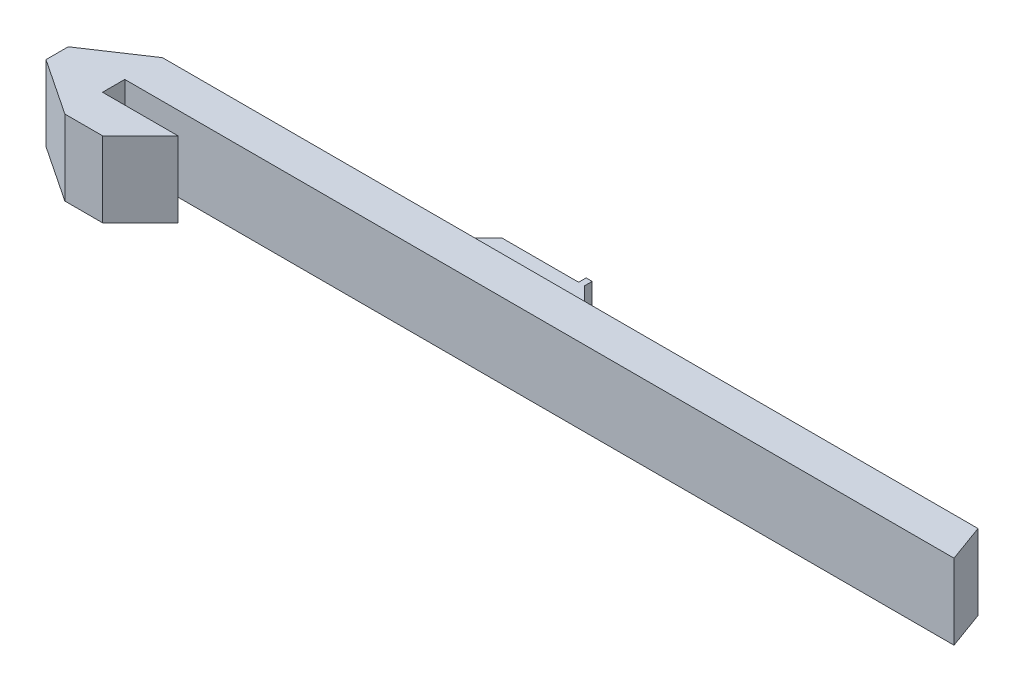
ISO-10303-21;
HEADER;
FILE_DESCRIPTION(('STEP AP214'),'2;1');
FILE_NAME('part.step','',(''),(''),'','','');
FILE_SCHEMA(('AUTOMOTIVE_DESIGN { 1 0 10303 214 1 1 1 1 }'));
ENDSEC;
DATA;
#1=APPLICATION_CONTEXT('core data for automotive mechanical design processes');
#2=APPLICATION_PROTOCOL_DEFINITION('international standard','automotive_design',2000,#1);
#3=PRODUCT_CONTEXT('',#1,'mechanical');
#4=PRODUCT('Part','Part','',(#3));
#5=PRODUCT_RELATED_PRODUCT_CATEGORY('part','',(#4));
#6=PRODUCT_DEFINITION_FORMATION('','',#4);
#7=PRODUCT_DEFINITION_CONTEXT('part definition',#1,'design');
#8=PRODUCT_DEFINITION('design','',#6,#7);
#9=PRODUCT_DEFINITION_SHAPE('','',#8);
#10=(LENGTH_UNIT() NAMED_UNIT(*) SI_UNIT(.MILLI.,.METRE.));
#11=(NAMED_UNIT(*) PLANE_ANGLE_UNIT() SI_UNIT($,.RADIAN.));
#12=(NAMED_UNIT(*) SI_UNIT($,.STERADIAN.) SOLID_ANGLE_UNIT());
#13=UNCERTAINTY_MEASURE_WITH_UNIT(LENGTH_MEASURE(1.E-05),#10,'distance_accuracy_value','');
#14=(GEOMETRIC_REPRESENTATION_CONTEXT(3) GLOBAL_UNCERTAINTY_ASSIGNED_CONTEXT((#13)) GLOBAL_UNIT_ASSIGNED_CONTEXT((#10,
#11,#12)) REPRESENTATION_CONTEXT('',''));
#15=CARTESIAN_POINT('',(0.,0.,0.));
#16=DIRECTION('',(0.,0.,1.));
#17=DIRECTION('',(1.,0.,0.));
#18=AXIS2_PLACEMENT_3D('',#15,#16,#17);
#19=CARTESIAN_POINT('',(61.,20.,-61.));
#20=DIRECTION('',(0.707106781186548,0.,-0.707106781186547));
#21=DIRECTION('',(-0.707106781186547,0.,-0.707106781186548));
#22=AXIS2_PLACEMENT_3D('',#19,#20,#21);
#23=PLANE('',#22);
#24=DIRECTION('',(0.,-1.,0.));
#25=VECTOR('',#24,1.);
#26=CARTESIAN_POINT('',(112.,20.,-9.99999999999999));
#27=LINE('',#26,#25);
#28=CARTESIAN_POINT('',(112.,13.6,-9.99999999999999));
#29=VERTEX_POINT('',#28);
#30=CARTESIAN_POINT('',(112.,6.4,-9.99999999999999));
#31=VERTEX_POINT('',#30);
#32=EDGE_CURVE('E197',#29,#31,#27,.T.);
#33=ORIENTED_EDGE('',*,*,#32,.T.);
#34=DIRECTION('',(0.707106781186547,0.,0.707106781186548));
#35=VECTOR('',#34,1.);
#36=CARTESIAN_POINT('',(112.,6.4,-9.99999999999999));
#37=LINE('',#36,#35);
#38=CARTESIAN_POINT('',(102.,6.4,-20.));
#39=VERTEX_POINT('',#38);
#40=EDGE_CURVE('E257',#39,#31,#37,.T.);
#41=ORIENTED_EDGE('',*,*,#40,.F.);
#42=DIRECTION('',(0.,-1.,0.));
#43=VECTOR('',#42,1.);
#44=CARTESIAN_POINT('',(102.,20.,-20.));
#45=LINE('',#44,#43);
#46=CARTESIAN_POINT('',(102.,13.6,-20.));
#47=VERTEX_POINT('',#46);
#48=EDGE_CURVE('E194',#47,#39,#45,.T.);
#49=ORIENTED_EDGE('',*,*,#48,.F.);
#50=DIRECTION('',(-0.707106781186547,0.,-0.707106781186548));
#51=VECTOR('',#50,1.);
#52=CARTESIAN_POINT('',(112.,13.6,-9.99999999999999));
#53=LINE('',#52,#51);
#54=EDGE_CURVE('E245',#29,#47,#53,.T.);
#55=ORIENTED_EDGE('',*,*,#54,.F.);
#56=EDGE_LOOP('',(#33,#41,#49,#55));
#57=FACE_BOUND('',#56,.T.);
#58=ADVANCED_FACE('F36',(#57),#23,.T.);
#59=CARTESIAN_POINT('',(0.,20.,-20.));
#60=DIRECTION('',(0.,0.,-1.));
#61=DIRECTION('',(-1.,0.,0.));
#62=AXIS2_PLACEMENT_3D('',#59,#60,#61);
#63=PLANE('',#62);
#64=DIRECTION('',(0.,1.,0.));
#65=VECTOR('',#64,1.);
#66=CARTESIAN_POINT('',(100.4,13.6,-20.));
#67=LINE('',#66,#65);
#68=CARTESIAN_POINT('',(100.4,6.4,-20.));
#69=VERTEX_POINT('',#68);
#70=CARTESIAN_POINT('',(100.4,13.6,-20.));
#71=VERTEX_POINT('',#70);
#72=EDGE_CURVE('E51',#69,#71,#67,.T.);
#73=ORIENTED_EDGE('',*,*,#72,.F.);
#74=DIRECTION('',(1.,0.,0.));
#75=VECTOR('',#74,1.);
#76=CARTESIAN_POINT('',(102.,6.4,-20.));
#77=LINE('',#76,#75);
#78=CARTESIAN_POINT('',(80.,6.4,-20.));
#79=VERTEX_POINT('',#78);
#80=EDGE_CURVE('E260',#79,#69,#77,.T.);
#81=ORIENTED_EDGE('',*,*,#80,.F.);
#82=DIRECTION('',(0.,-1.,0.));
#83=VECTOR('',#82,1.);
#84=CARTESIAN_POINT('',(80.,20.,-20.));
#85=LINE('',#84,#83);
#86=CARTESIAN_POINT('',(80.,13.6,-20.));
#87=VERTEX_POINT('',#86);
#88=EDGE_CURVE('E191',#87,#79,#85,.T.);
#89=ORIENTED_EDGE('',*,*,#88,.F.);
#90=DIRECTION('',(-1.,0.,0.));
#91=VECTOR('',#90,1.);
#92=CARTESIAN_POINT('',(102.,13.6,-20.));
#93=LINE('',#92,#91);
#94=EDGE_CURVE('E160',#71,#87,#93,.T.);
#95=ORIENTED_EDGE('',*,*,#94,.F.);
#96=EDGE_LOOP('',(#73,#81,#89,#95));
#97=FACE_BOUND('',#96,.T.);
#98=ADVANCED_FACE('F335',(#97),#63,.T.);
#99=CARTESIAN_POINT('',(29.9999999999999,20.,30.));
#100=DIRECTION('',(-0.707106781186547,0.,-0.707106781186548));
#101=DIRECTION('',(-0.707106781186548,0.,0.707106781186547));
#102=AXIS2_PLACEMENT_3D('',#99,#100,#101);
#103=PLANE('',#102);
#104=ORIENTED_EDGE('',*,*,#88,.T.);
#105=DIRECTION('',(0.707106781186549,0.,-0.707106781186546));
#106=VECTOR('',#105,1.);
#107=CARTESIAN_POINT('',(80.,6.4,-20.));
#108=LINE('',#107,#106);
#109=CARTESIAN_POINT('',(70.,6.4,-9.99999999999998));
#110=VERTEX_POINT('',#109);
#111=EDGE_CURVE('E262',#110,#79,#108,.T.);
#112=ORIENTED_EDGE('',*,*,#111,.F.);
#113=DIRECTION('',(0.,-1.,0.));
#114=VECTOR('',#113,1.);
#115=CARTESIAN_POINT('',(70.,20.,-9.99999999999998));
#116=LINE('',#115,#114);
#117=CARTESIAN_POINT('',(70.,13.6,-9.99999999999998));
#118=VERTEX_POINT('',#117);
#119=EDGE_CURVE('E188',#118,#110,#116,.T.);
#120=ORIENTED_EDGE('',*,*,#119,.F.);
#121=DIRECTION('',(-0.707106781186549,0.,0.707106781186546));
#122=VECTOR('',#121,1.);
#123=CARTESIAN_POINT('',(80.,13.6,-20.));
#124=LINE('',#123,#122);
#125=EDGE_CURVE('E251',#87,#118,#124,.T.);
#126=ORIENTED_EDGE('',*,*,#125,.F.);
#127=EDGE_LOOP('',(#104,#112,#120,#126));
#128=FACE_BOUND('',#127,.T.);
#129=ADVANCED_FACE('F333',(#128),#103,.T.);
#130=CARTESIAN_POINT('',(0.,20.,5.9));
#131=DIRECTION('',(0.,0.,1.));
#132=DIRECTION('',(1.,0.,0.));
#133=AXIS2_PLACEMENT_3D('',#130,#131,#132);
#134=PLANE('',#133);
#135=DIRECTION('',(-1.,0.,0.));
#136=VECTOR('',#135,1.);
#137=CARTESIAN_POINT('',(0.,0.,5.9));
#138=LINE('',#137,#136);
#139=CARTESIAN_POINT('',(20.,0.,5.9));
#140=VERTEX_POINT('',#139);
#141=CARTESIAN_POINT('',(0.,0.,5.9));
#142=VERTEX_POINT('',#141);
#143=EDGE_CURVE('E156',#140,#142,#138,.T.);
#144=ORIENTED_EDGE('',*,*,#143,.T.);
#145=DIRECTION('',(0.,-1.,0.));
#146=VECTOR('',#145,1.);
#147=CARTESIAN_POINT('',(0.,20.,5.9));
#148=LINE('',#147,#146);
#149=CARTESIAN_POINT('',(0.,20.,5.9));
#150=VERTEX_POINT('',#149);
#151=EDGE_CURVE('E11',#150,#142,#148,.T.);
#152=ORIENTED_EDGE('',*,*,#151,.F.);
#153=DIRECTION('',(-1.,0.,0.));
#154=VECTOR('',#153,1.);
#155=CARTESIAN_POINT('',(0.,20.,5.9));
#156=LINE('',#155,#154);
#157=CARTESIAN_POINT('',(20.,20.,5.9));
#158=VERTEX_POINT('',#157);
#159=EDGE_CURVE('E178',#158,#150,#156,.T.);
#160=ORIENTED_EDGE('',*,*,#159,.F.);
#161=DIRECTION('',(0.,-1.,0.));
#162=VECTOR('',#161,1.);
#163=CARTESIAN_POINT('',(20.,20.,5.9));
#164=LINE('',#163,#162);
#165=EDGE_CURVE('E152',#158,#140,#164,.T.);
#166=ORIENTED_EDGE('',*,*,#165,.T.);
#167=EDGE_LOOP('',(#144,#152,#160,#166));
#168=FACE_BOUND('',#167,.T.);
#169=ADVANCED_FACE('F38',(#168),#134,.F.);
#170=CARTESIAN_POINT('',(0.,20.,0.));
#171=DIRECTION('',(-1.,0.,0.));
#172=DIRECTION('',(0.,0.,1.));
#173=AXIS2_PLACEMENT_3D('',#170,#171,#172);
#174=PLANE('',#173);
#175=DIRECTION('',(0.,0.,-1.));
#176=VECTOR('',#175,1.);
#177=CARTESIAN_POINT('',(0.,0.,0.));
#178=LINE('',#177,#176);
#179=CARTESIAN_POINT('',(0.,0.,0.));
#180=VERTEX_POINT('',#179);
#181=EDGE_CURVE('E159',#142,#180,#178,.T.);
#182=ORIENTED_EDGE('',*,*,#181,.T.);
#183=DIRECTION('',(0.,-1.,0.));
#184=VECTOR('',#183,1.);
#185=CARTESIAN_POINT('',(0.,20.,0.));
#186=LINE('',#185,#184);
#187=CARTESIAN_POINT('',(0.,20.,0.));
#188=VERTEX_POINT('',#187);
#189=EDGE_CURVE('E44',#188,#180,#186,.T.);
#190=ORIENTED_EDGE('',*,*,#189,.F.);
#191=DIRECTION('',(0.,0.,-1.));
#192=VECTOR('',#191,1.);
#193=CARTESIAN_POINT('',(0.,20.,0.));
#194=LINE('',#193,#192);
#195=EDGE_CURVE('E107',#150,#188,#194,.T.);
#196=ORIENTED_EDGE('',*,*,#195,.F.);
#197=ORIENTED_EDGE('',*,*,#151,.T.);
#198=EDGE_LOOP('',(#182,#190,#196,#197));
#199=FACE_BOUND('',#198,.T.);
#200=ADVANCED_FACE('F363',(#199),#174,.F.);
#201=CARTESIAN_POINT('',(0.,20.,0.));
#202=DIRECTION('',(0.,0.,-1.));
#203=DIRECTION('',(-1.,0.,0.));
#204=AXIS2_PLACEMENT_3D('',#201,#202,#203);
#205=PLANE('',#204);
#206=DIRECTION('',(1.,0.,0.));
#207=VECTOR('',#206,1.);
#208=CARTESIAN_POINT('',(0.,0.,0.));
#209=LINE('',#208,#207);
#210=CARTESIAN_POINT('',(220.,0.,0.));
#211=VERTEX_POINT('',#210);
#212=EDGE_CURVE('E162',#180,#211,#209,.T.);
#213=ORIENTED_EDGE('',*,*,#212,.T.);
#214=DIRECTION('',(0.,-1.,0.));
#215=VECTOR('',#214,1.);
#216=CARTESIAN_POINT('',(220.,20.,0.));
#217=LINE('',#216,#215);
#218=CARTESIAN_POINT('',(220.,20.,0.));
#219=VERTEX_POINT('',#218);
#220=EDGE_CURVE('E203',#219,#211,#217,.T.);
#221=ORIENTED_EDGE('',*,*,#220,.F.);
#222=DIRECTION('',(1.,0.,0.));
#223=VECTOR('',#222,1.);
#224=CARTESIAN_POINT('',(0.,20.,0.));
#225=LINE('',#224,#223);
#226=EDGE_CURVE('E210',#188,#219,#225,.T.);
#227=ORIENTED_EDGE('',*,*,#226,.F.);
#228=ORIENTED_EDGE('',*,*,#189,.T.);
#229=EDGE_LOOP('',(#213,#221,#227,#228));
#230=FACE_BOUND('',#229,.T.);
#231=ADVANCED_FACE('F208',(#230),#205,.F.);
#232=CARTESIAN_POINT('',(194.264888743088,20.,-70.7066370655186));
#233=DIRECTION('',(0.93969262078591,0.,-0.342020143325665));
#234=DIRECTION('',(-0.342020143325665,0.,-0.93969262078591));
#235=AXIS2_PLACEMENT_3D('',#232,#233,#234);
#236=PLANE('',#235);
#237=DIRECTION('',(0.342020143325665,0.,0.93969262078591));
#238=VECTOR('',#237,1.);
#239=CARTESIAN_POINT('',(194.264888743088,0.,-70.7066370655186));
#240=LINE('',#239,#238);
#241=CARTESIAN_POINT('',(216.360297657338,0.,-10.));
#242=VERTEX_POINT('',#241);
#243=EDGE_CURVE('E165',#242,#211,#240,.T.);
#244=ORIENTED_EDGE('',*,*,#243,.F.);
#245=DIRECTION('',(0.,-1.,0.));
#246=VECTOR('',#245,1.);
#247=CARTESIAN_POINT('',(216.360297657338,20.,-10.));
#248=LINE('',#247,#246);
#249=CARTESIAN_POINT('',(216.360297657338,20.,-10.));
#250=VERTEX_POINT('',#249);
#251=EDGE_CURVE('E200',#250,#242,#248,.T.);
#252=ORIENTED_EDGE('',*,*,#251,.F.);
#253=DIRECTION('',(0.342020143325665,0.,0.93969262078591));
#254=VECTOR('',#253,1.);
#255=CARTESIAN_POINT('',(194.264888743088,20.,-70.7066370655186));
#256=LINE('',#255,#254);
#257=EDGE_CURVE('E221',#250,#219,#256,.T.);
#258=ORIENTED_EDGE('',*,*,#257,.T.);
#259=ORIENTED_EDGE('',*,*,#220,.T.);
#260=EDGE_LOOP('',(#244,#252,#258,#259));
#261=FACE_BOUND('',#260,.T.);
#262=ADVANCED_FACE('F217',(#261),#236,.T.);
#263=CARTESIAN_POINT('',(0.,20.,-9.99999999999997));
#264=DIRECTION('',(0.,0.,1.));
#265=DIRECTION('',(1.,0.,0.));
#266=AXIS2_PLACEMENT_3D('',#263,#264,#265);
#267=PLANE('',#266);
#268=ORIENTED_EDGE('',*,*,#251,.T.);
#269=DIRECTION('',(-1.,0.,0.));
#270=VECTOR('',#269,1.);
#271=CARTESIAN_POINT('',(0.,0.,-9.99999999999997));
#272=LINE('',#271,#270);
#273=CARTESIAN_POINT('',(0.,0.,-9.99999999999997));
#274=VERTEX_POINT('',#273);
#275=EDGE_CURVE('E168',#242,#274,#272,.T.);
#276=ORIENTED_EDGE('',*,*,#275,.T.);
#277=DIRECTION('',(0.,-1.,0.));
#278=VECTOR('',#277,1.);
#279=CARTESIAN_POINT('',(0.,20.,-9.99999999999997));
#280=LINE('',#279,#278);
#281=CARTESIAN_POINT('',(0.,20.,-9.99999999999997));
#282=VERTEX_POINT('',#281);
#283=EDGE_CURVE('E185',#282,#274,#280,.T.);
#284=ORIENTED_EDGE('',*,*,#283,.F.);
#285=DIRECTION('',(-1.,0.,0.));
#286=VECTOR('',#285,1.);
#287=CARTESIAN_POINT('',(0.,20.,-9.99999999999997));
#288=LINE('',#287,#286);
#289=EDGE_CURVE('E222',#250,#282,#288,.T.);
#290=ORIENTED_EDGE('',*,*,#289,.F.);
#291=EDGE_LOOP('',(#268,#276,#284,#290));
#292=FACE_BOUND('',#291,.T.);
#293=ORIENTED_EDGE('',*,*,#119,.T.);
#294=DIRECTION('',(-1.,0.,0.));
#295=VECTOR('',#294,1.);
#296=CARTESIAN_POINT('',(70.,6.4,-9.99999999999998));
#297=LINE('',#296,#295);
#298=EDGE_CURVE('E254',#31,#110,#297,.T.);
#299=ORIENTED_EDGE('',*,*,#298,.F.);
#300=ORIENTED_EDGE('',*,*,#32,.F.);
#301=DIRECTION('',(1.,0.,0.));
#302=VECTOR('',#301,1.);
#303=CARTESIAN_POINT('',(70.,13.6,-9.99999999999998));
#304=LINE('',#303,#302);
#305=EDGE_CURVE('E248',#118,#29,#304,.T.);
#306=ORIENTED_EDGE('',*,*,#305,.F.);
#307=EDGE_LOOP('',(#293,#299,#300,#306));
#308=FACE_BOUND('',#307,.T.);
#309=ADVANCED_FACE('F361',(#292,#308),#267,.F.);
#310=CARTESIAN_POINT('',(-4.6153846153846,20.,-6.92307692307692));
#311=DIRECTION('',(0.554700196225228,0.,0.832050294337844));
#312=DIRECTION('',(0.832050294337844,0.,-0.554700196225228));
#313=AXIS2_PLACEMENT_3D('',#310,#311,#312);
#314=PLANE('',#313);
#315=DIRECTION('',(-0.832050294337844,0.,0.554700196225228));
#316=VECTOR('',#315,1.);
#317=CARTESIAN_POINT('',(-4.6153846153846,0.,-6.92307692307692));
#318=LINE('',#317,#316);
#319=CARTESIAN_POINT('',(-15.,0.,0.));
#320=VERTEX_POINT('',#319);
#321=EDGE_CURVE('E170',#274,#320,#318,.T.);
#322=ORIENTED_EDGE('',*,*,#321,.T.);
#323=DIRECTION('',(0.,-1.,0.));
#324=VECTOR('',#323,1.);
#325=CARTESIAN_POINT('',(-15.,20.,0.));
#326=LINE('',#325,#324);
#327=CARTESIAN_POINT('',(-15.,20.,0.));
#328=VERTEX_POINT('',#327);
#329=EDGE_CURVE('E182',#328,#320,#326,.T.);
#330=ORIENTED_EDGE('',*,*,#329,.F.);
#331=DIRECTION('',(-0.832050294337844,0.,0.554700196225228));
#332=VECTOR('',#331,1.);
#333=CARTESIAN_POINT('',(-4.6153846153846,20.,-6.92307692307692));
#334=LINE('',#333,#332);
#335=EDGE_CURVE('E224',#282,#328,#334,.T.);
#336=ORIENTED_EDGE('',*,*,#335,.F.);
#337=ORIENTED_EDGE('',*,*,#283,.T.);
#338=EDGE_LOOP('',(#322,#330,#336,#337));
#339=FACE_BOUND('',#338,.T.);
#340=ADVANCED_FACE('F233',(#339),#314,.F.);
#341=CARTESIAN_POINT('',(-15.,20.,0.));
#342=DIRECTION('',(1.,0.,0.));
#343=DIRECTION('',(0.,0.,-1.));
#344=AXIS2_PLACEMENT_3D('',#341,#342,#343);
#345=PLANE('',#344);
#346=DIRECTION('',(0.,0.,1.));
#347=VECTOR('',#346,1.);
#348=CARTESIAN_POINT('',(-15.,0.,0.));
#349=LINE('',#348,#347);
#350=CARTESIAN_POINT('',(-15.,0.,5.9));
#351=VERTEX_POINT('',#350);
#352=EDGE_CURVE('E172',#320,#351,#349,.T.);
#353=ORIENTED_EDGE('',*,*,#352,.T.);
#354=DIRECTION('',(0.,-1.,0.));
#355=VECTOR('',#354,1.);
#356=CARTESIAN_POINT('',(-15.,20.,5.9));
#357=LINE('',#356,#355);
#358=CARTESIAN_POINT('',(-15.,20.,5.9));
#359=VERTEX_POINT('',#358);
#360=EDGE_CURVE('E147',#359,#351,#357,.T.);
#361=ORIENTED_EDGE('',*,*,#360,.F.);
#362=DIRECTION('',(0.,0.,1.));
#363=VECTOR('',#362,1.);
#364=CARTESIAN_POINT('',(-15.,20.,0.));
#365=LINE('',#364,#363);
#366=EDGE_CURVE('E135',#328,#359,#365,.T.);
#367=ORIENTED_EDGE('',*,*,#366,.F.);
#368=ORIENTED_EDGE('',*,*,#329,.T.);
#369=EDGE_LOOP('',(#353,#361,#367,#368));
#370=FACE_BOUND('',#369,.T.);
#371=ADVANCED_FACE('F236',(#370),#345,.F.);
#372=CARTESIAN_POINT('',(-7.33846153846154,20.,11.0076923076923));
#373=DIRECTION('',(0.554700196225229,0.,-0.832050294337844));
#374=DIRECTION('',(-0.832050294337844,0.,-0.554700196225229));
#375=AXIS2_PLACEMENT_3D('',#372,#373,#374);
#376=PLANE('',#375);
#377=DIRECTION('',(0.832050294337844,0.,0.554700196225229));
#378=VECTOR('',#377,1.);
#379=CARTESIAN_POINT('',(-7.33846153846154,0.,11.0076923076923));
#380=LINE('',#379,#378);
#381=CARTESIAN_POINT('',(0.,0.,15.9));
#382=VERTEX_POINT('',#381);
#383=EDGE_CURVE('E144',#351,#382,#380,.T.);
#384=ORIENTED_EDGE('',*,*,#383,.T.);
#385=DIRECTION('',(0.,-1.,0.));
#386=VECTOR('',#385,1.);
#387=CARTESIAN_POINT('',(0.,20.,15.9));
#388=LINE('',#387,#386);
#389=CARTESIAN_POINT('',(0.,20.,15.9));
#390=VERTEX_POINT('',#389);
#391=EDGE_CURVE('E141',#390,#382,#388,.T.);
#392=ORIENTED_EDGE('',*,*,#391,.F.);
#393=DIRECTION('',(0.832050294337844,0.,0.554700196225229));
#394=VECTOR('',#393,1.);
#395=CARTESIAN_POINT('',(-7.33846153846154,20.,11.0076923076923));
#396=LINE('',#395,#394);
#397=EDGE_CURVE('E128',#359,#390,#396,.T.);
#398=ORIENTED_EDGE('',*,*,#397,.F.);
#399=ORIENTED_EDGE('',*,*,#360,.T.);
#400=EDGE_LOOP('',(#384,#392,#398,#399));
#401=FACE_BOUND('',#400,.T.);
#402=ADVANCED_FACE('F142',(#401),#376,.F.);
#403=CARTESIAN_POINT('',(0.,20.,15.9));
#404=DIRECTION('',(0.,0.,-1.));
#405=DIRECTION('',(-1.,0.,0.));
#406=AXIS2_PLACEMENT_3D('',#403,#404,#405);
#407=PLANE('',#406);
#408=DIRECTION('',(1.,0.,0.));
#409=VECTOR('',#408,1.);
#410=CARTESIAN_POINT('',(0.,0.,15.9));
#411=LINE('',#410,#409);
#412=CARTESIAN_POINT('',(10.,0.,15.9));
#413=VERTEX_POINT('',#412);
#414=EDGE_CURVE('E175',#382,#413,#411,.T.);
#415=ORIENTED_EDGE('',*,*,#414,.T.);
#416=DIRECTION('',(0.,-1.,0.));
#417=VECTOR('',#416,1.);
#418=CARTESIAN_POINT('',(10.,20.,15.9));
#419=LINE('',#418,#417);
#420=CARTESIAN_POINT('',(10.,20.,15.9));
#421=VERTEX_POINT('',#420);
#422=EDGE_CURVE('E148',#421,#413,#419,.T.);
#423=ORIENTED_EDGE('',*,*,#422,.F.);
#424=DIRECTION('',(1.,0.,0.));
#425=VECTOR('',#424,1.);
#426=CARTESIAN_POINT('',(0.,20.,15.9));
#427=LINE('',#426,#425);
#428=EDGE_CURVE('E132',#390,#421,#427,.T.);
#429=ORIENTED_EDGE('',*,*,#428,.F.);
#430=ORIENTED_EDGE('',*,*,#391,.T.);
#431=EDGE_LOOP('',(#415,#423,#429,#430));
#432=FACE_BOUND('',#431,.T.);
#433=ADVANCED_FACE('F150',(#432),#407,.F.);
#434=CARTESIAN_POINT('',(12.95,20.,12.95));
#435=DIRECTION('',(-0.707106781186549,0.,-0.707106781186546));
#436=DIRECTION('',(-0.707106781186546,0.,0.707106781186549));
#437=AXIS2_PLACEMENT_3D('',#434,#435,#436);
#438=PLANE('',#437);
#439=DIRECTION('',(0.707106781186546,0.,-0.707106781186549));
#440=VECTOR('',#439,1.);
#441=CARTESIAN_POINT('',(12.95,0.,12.95));
#442=LINE('',#441,#440);
#443=EDGE_CURVE('E99',#413,#140,#442,.T.);
#444=ORIENTED_EDGE('',*,*,#443,.T.);
#445=ORIENTED_EDGE('',*,*,#165,.F.);
#446=DIRECTION('',(0.707106781186546,0.,-0.707106781186549));
#447=VECTOR('',#446,1.);
#448=CARTESIAN_POINT('',(12.95,20.,12.95));
#449=LINE('',#448,#447);
#450=EDGE_CURVE('E60',#421,#158,#449,.T.);
#451=ORIENTED_EDGE('',*,*,#450,.F.);
#452=ORIENTED_EDGE('',*,*,#422,.T.);
#453=EDGE_LOOP('',(#444,#445,#451,#452));
#454=FACE_BOUND('',#453,.T.);
#455=ADVANCED_FACE('F237',(#454),#438,.F.);
#456=CARTESIAN_POINT('',(0.,20.,0.));
#457=DIRECTION('',(0.,1.,0.));
#458=DIRECTION('',(0.,0.,1.));
#459=AXIS2_PLACEMENT_3D('',#456,#457,#458);
#460=PLANE('',#459);
#461=ORIENTED_EDGE('',*,*,#289,.T.);
#462=ORIENTED_EDGE('',*,*,#335,.T.);
#463=ORIENTED_EDGE('',*,*,#366,.T.);
#464=ORIENTED_EDGE('',*,*,#397,.T.);
#465=ORIENTED_EDGE('',*,*,#428,.T.);
#466=ORIENTED_EDGE('',*,*,#450,.T.);
#467=ORIENTED_EDGE('',*,*,#159,.T.);
#468=ORIENTED_EDGE('',*,*,#195,.T.);
#469=ORIENTED_EDGE('',*,*,#226,.T.);
#470=ORIENTED_EDGE('',*,*,#257,.F.);
#471=EDGE_LOOP('',(#461,#462,#463,#464,#465,#466,#467,#468,#469,#470));
#472=FACE_BOUND('',#471,.T.);
#473=ADVANCED_FACE('F130',(#472),#460,.T.);
#474=CARTESIAN_POINT('',(0.,0.,0.));
#475=DIRECTION('',(0.,1.,0.));
#476=DIRECTION('',(0.,0.,1.));
#477=AXIS2_PLACEMENT_3D('',#474,#475,#476);
#478=PLANE('',#477);
#479=ORIENTED_EDGE('',*,*,#275,.F.);
#480=ORIENTED_EDGE('',*,*,#243,.T.);
#481=ORIENTED_EDGE('',*,*,#212,.F.);
#482=ORIENTED_EDGE('',*,*,#181,.F.);
#483=ORIENTED_EDGE('',*,*,#143,.F.);
#484=ORIENTED_EDGE('',*,*,#443,.F.);
#485=ORIENTED_EDGE('',*,*,#414,.F.);
#486=ORIENTED_EDGE('',*,*,#383,.F.);
#487=ORIENTED_EDGE('',*,*,#352,.F.);
#488=ORIENTED_EDGE('',*,*,#321,.F.);
#489=EDGE_LOOP('',(#479,#480,#481,#482,#483,#484,#485,#486,#487,#488));
#490=FACE_BOUND('',#489,.T.);
#491=ADVANCED_FACE('F212',(#490),#478,.F.);
#492=CARTESIAN_POINT('',(0.,13.6,0.));
#493=DIRECTION('',(0.,-1.,0.));
#494=DIRECTION('',(0.,0.,-1.));
#495=AXIS2_PLACEMENT_3D('',#492,#493,#494);
#496=PLANE('',#495);
#497=ORIENTED_EDGE('',*,*,#125,.T.);
#498=ORIENTED_EDGE('',*,*,#305,.T.);
#499=ORIENTED_EDGE('',*,*,#54,.T.);
#500=DIRECTION('',(0.,0.,1.));
#501=VECTOR('',#500,1.);
#502=CARTESIAN_POINT('',(102.,13.6,-22.));
#503=LINE('',#502,#501);
#504=CARTESIAN_POINT('',(102.,13.6,-22.));
#505=VERTEX_POINT('',#504);
#506=EDGE_CURVE('E274',#505,#47,#503,.T.);
#507=ORIENTED_EDGE('',*,*,#506,.F.);
#508=DIRECTION('',(1.,0.,0.));
#509=VECTOR('',#508,1.);
#510=CARTESIAN_POINT('',(102.,13.6,-22.));
#511=LINE('',#510,#509);
#512=CARTESIAN_POINT('',(100.4,13.6,-22.));
#513=VERTEX_POINT('',#512);
#514=EDGE_CURVE('E277',#513,#505,#511,.T.);
#515=ORIENTED_EDGE('',*,*,#514,.F.);
#516=DIRECTION('',(0.,0.,1.));
#517=VECTOR('',#516,1.);
#518=CARTESIAN_POINT('',(100.4,13.6,-22.));
#519=LINE('',#518,#517);
#520=EDGE_CURVE('E271',#513,#71,#519,.T.);
#521=ORIENTED_EDGE('',*,*,#520,.T.);
#522=ORIENTED_EDGE('',*,*,#94,.T.);
#523=EDGE_LOOP('',(#497,#498,#499,#507,#515,#521,#522));
#524=FACE_BOUND('',#523,.T.);
#525=ADVANCED_FACE('F328',(#524),#496,.F.);
#526=CARTESIAN_POINT('',(0.,6.4,0.));
#527=DIRECTION('',(0.,-1.,0.));
#528=DIRECTION('',(0.,0.,-1.));
#529=AXIS2_PLACEMENT_3D('',#526,#527,#528);
#530=PLANE('',#529);
#531=ORIENTED_EDGE('',*,*,#111,.T.);
#532=ORIENTED_EDGE('',*,*,#80,.T.);
#533=DIRECTION('',(0.,0.,1.));
#534=VECTOR('',#533,1.);
#535=CARTESIAN_POINT('',(100.4,6.4,-22.));
#536=LINE('',#535,#534);
#537=CARTESIAN_POINT('',(100.4,6.4,-22.));
#538=VERTEX_POINT('',#537);
#539=EDGE_CURVE('E268',#538,#69,#536,.T.);
#540=ORIENTED_EDGE('',*,*,#539,.F.);
#541=DIRECTION('',(-1.,0.,0.));
#542=VECTOR('',#541,1.);
#543=CARTESIAN_POINT('',(102.,6.4,-22.));
#544=LINE('',#543,#542);
#545=CARTESIAN_POINT('',(102.,6.4,-22.));
#546=VERTEX_POINT('',#545);
#547=EDGE_CURVE('E285',#546,#538,#544,.T.);
#548=ORIENTED_EDGE('',*,*,#547,.F.);
#549=DIRECTION('',(0.,0.,1.));
#550=VECTOR('',#549,1.);
#551=CARTESIAN_POINT('',(102.,6.4,-22.));
#552=LINE('',#551,#550);
#553=EDGE_CURVE('E265',#546,#39,#552,.T.);
#554=ORIENTED_EDGE('',*,*,#553,.T.);
#555=ORIENTED_EDGE('',*,*,#40,.T.);
#556=ORIENTED_EDGE('',*,*,#298,.T.);
#557=EDGE_LOOP('',(#531,#532,#540,#548,#554,#555,#556));
#558=FACE_BOUND('',#557,.T.);
#559=ADVANCED_FACE('F307',(#558),#530,.T.);
#560=CARTESIAN_POINT('',(102.,13.6,-22.));
#561=DIRECTION('',(-1.,0.,0.));
#562=DIRECTION('',(0.,0.,1.));
#563=AXIS2_PLACEMENT_3D('',#560,#561,#562);
#564=PLANE('',#563);
#565=ORIENTED_EDGE('',*,*,#48,.T.);
#566=ORIENTED_EDGE('',*,*,#553,.F.);
#567=DIRECTION('',(0.,-1.,0.));
#568=VECTOR('',#567,1.);
#569=CARTESIAN_POINT('',(102.,13.6,-22.));
#570=LINE('',#569,#568);
#571=EDGE_CURVE('E279',#505,#546,#570,.T.);
#572=ORIENTED_EDGE('',*,*,#571,.F.);
#573=ORIENTED_EDGE('',*,*,#506,.T.);
#574=EDGE_LOOP('',(#565,#566,#572,#573));
#575=FACE_BOUND('',#574,.T.);
#576=ADVANCED_FACE('F303',(#575),#564,.F.);
#577=CARTESIAN_POINT('',(100.4,13.6,-22.));
#578=DIRECTION('',(1.,0.,0.));
#579=DIRECTION('',(0.,0.,-1.));
#580=AXIS2_PLACEMENT_3D('',#577,#578,#579);
#581=PLANE('',#580);
#582=ORIENTED_EDGE('',*,*,#72,.T.);
#583=ORIENTED_EDGE('',*,*,#520,.F.);
#584=DIRECTION('',(0.,1.,0.));
#585=VECTOR('',#584,1.);
#586=CARTESIAN_POINT('',(100.4,13.6,-22.));
#587=LINE('',#586,#585);
#588=EDGE_CURVE('E282',#538,#513,#587,.T.);
#589=ORIENTED_EDGE('',*,*,#588,.F.);
#590=ORIENTED_EDGE('',*,*,#539,.T.);
#591=EDGE_LOOP('',(#582,#583,#589,#590));
#592=FACE_BOUND('',#591,.T.);
#593=ADVANCED_FACE('F338',(#592),#581,.F.);
#594=CARTESIAN_POINT('',(0.,0.,-22.));
#595=DIRECTION('',(0.,0.,-1.));
#596=DIRECTION('',(-1.,0.,0.));
#597=AXIS2_PLACEMENT_3D('',#594,#595,#596);
#598=PLANE('',#597);
#599=ORIENTED_EDGE('',*,*,#571,.T.);
#600=ORIENTED_EDGE('',*,*,#547,.T.);
#601=ORIENTED_EDGE('',*,*,#588,.T.);
#602=ORIENTED_EDGE('',*,*,#514,.T.);
#603=EDGE_LOOP('',(#599,#600,#601,#602));
#604=FACE_BOUND('',#603,.T.);
#605=ADVANCED_FACE('F293',(#604),#598,.T.);
#606=CLOSED_SHELL('',(#58,#98,#129,#169,#200,#231,#262,#309,#340,#371,#402,#433,#455,#473,#491,
#525,#559,#576,#593,#605));
#607=MANIFOLD_SOLID_BREP('B2',#606);
#608=ADVANCED_BREP_SHAPE_REPRESENTATION('',(#18,#607),#14);
#609=SHAPE_DEFINITION_REPRESENTATION(#9,#608);
ENDSEC;
END-ISO-10303-21;
